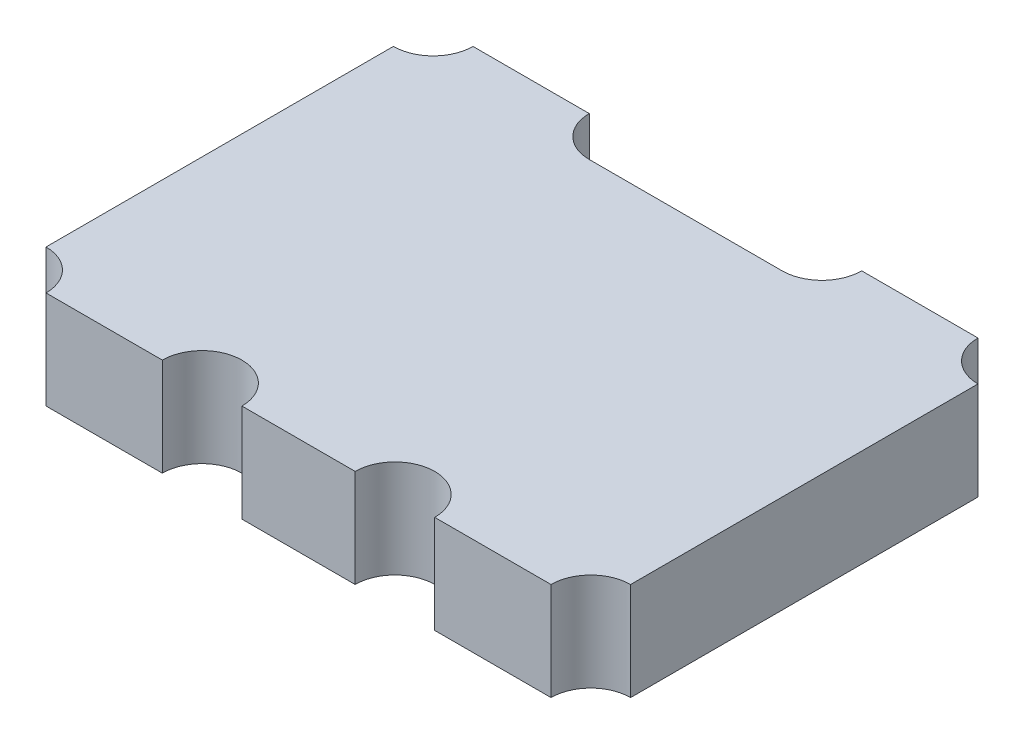
ISO-10303-21;
HEADER;
FILE_DESCRIPTION(('STEP AP214'),'2;1');
FILE_NAME('part.step','',(''),(''),'','','');
FILE_SCHEMA(('AUTOMOTIVE_DESIGN { 1 0 10303 214 1 1 1 1 }'));
ENDSEC;
DATA;
#1=APPLICATION_CONTEXT('core data for automotive mechanical design processes');
#2=APPLICATION_PROTOCOL_DEFINITION('international standard','automotive_design',2000,#1);
#3=PRODUCT_CONTEXT('',#1,'mechanical');
#4=PRODUCT('Part','Part','',(#3));
#5=PRODUCT_RELATED_PRODUCT_CATEGORY('part','',(#4));
#6=PRODUCT_DEFINITION_FORMATION('','',#4);
#7=PRODUCT_DEFINITION_CONTEXT('part definition',#1,'design');
#8=PRODUCT_DEFINITION('design','',#6,#7);
#9=PRODUCT_DEFINITION_SHAPE('','',#8);
#10=(LENGTH_UNIT() NAMED_UNIT(*) SI_UNIT(.MILLI.,.METRE.));
#11=(NAMED_UNIT(*) PLANE_ANGLE_UNIT() SI_UNIT($,.RADIAN.));
#12=(NAMED_UNIT(*) SI_UNIT($,.STERADIAN.) SOLID_ANGLE_UNIT());
#13=UNCERTAINTY_MEASURE_WITH_UNIT(LENGTH_MEASURE(1.E-05),#10,'distance_accuracy_value','');
#14=(GEOMETRIC_REPRESENTATION_CONTEXT(3) GLOBAL_UNCERTAINTY_ASSIGNED_CONTEXT((#13)) GLOBAL_UNIT_ASSIGNED_CONTEXT((#10,
#11,#12)) REPRESENTATION_CONTEXT('',''));
#15=CARTESIAN_POINT('',(0.,0.,0.));
#16=DIRECTION('',(0.,0.,1.));
#17=DIRECTION('',(1.,0.,0.));
#18=AXIS2_PLACEMENT_3D('',#15,#16,#17);
#19=CARTESIAN_POINT('',(-1.91,-0.64,-1.395));
#20=DIRECTION('',(0.,1.,0.));
#21=DIRECTION('',(0.,0.,1.));
#22=AXIS2_PLACEMENT_3D('',#19,#20,#21);
#23=CYLINDRICAL_SURFACE('',#22,0.26);
#24=CARTESIAN_POINT('',(-1.91,0.,-1.395));
#25=DIRECTION('',(0.,-1.,0.));
#26=DIRECTION('',(0.,0.,1.));
#27=AXIS2_PLACEMENT_3D('',#24,#25,#26);
#28=CIRCLE('',#27,0.26);
#29=CARTESIAN_POINT('',(-1.65,0.,-1.395));
#30=VERTEX_POINT('',#29);
#31=CARTESIAN_POINT('',(-1.91,0.,-1.135));
#32=VERTEX_POINT('',#31);
#33=EDGE_CURVE('E11',#30,#32,#28,.T.);
#34=ORIENTED_EDGE('',*,*,#33,.F.);
#35=DIRECTION('',(0.,1.,0.));
#36=VECTOR('',#35,1.);
#37=CARTESIAN_POINT('',(-1.65,-0.64,-1.395));
#38=LINE('',#37,#36);
#39=CARTESIAN_POINT('',(-1.65,-0.64,-1.395));
#40=VERTEX_POINT('',#39);
#41=EDGE_CURVE('E24',#40,#30,#38,.T.);
#42=ORIENTED_EDGE('',*,*,#41,.F.);
#43=CARTESIAN_POINT('',(-1.91,-0.64,-1.395));
#44=DIRECTION('',(0.,-1.,0.));
#45=DIRECTION('',(0.,0.,1.));
#46=AXIS2_PLACEMENT_3D('',#43,#44,#45);
#47=CIRCLE('',#46,0.26);
#48=CARTESIAN_POINT('',(-1.91,-0.64,-1.135));
#49=VERTEX_POINT('',#48);
#50=EDGE_CURVE('E262',#40,#49,#47,.T.);
#51=ORIENTED_EDGE('',*,*,#50,.T.);
#52=DIRECTION('',(0.,1.,0.));
#53=VECTOR('',#52,1.);
#54=CARTESIAN_POINT('',(-1.91,-0.64,-1.135));
#55=LINE('',#54,#53);
#56=EDGE_CURVE('E37',#49,#32,#55,.T.);
#57=ORIENTED_EDGE('',*,*,#56,.T.);
#58=EDGE_LOOP('',(#34,#42,#51,#57));
#59=FACE_BOUND('',#58,.T.);
#60=ADVANCED_FACE('F17',(#59),#23,.F.);
#61=CARTESIAN_POINT('',(-1.65,-0.64,-1.395));
#62=DIRECTION('',(0.,0.,-1.));
#63=DIRECTION('',(-1.,0.,0.));
#64=AXIS2_PLACEMENT_3D('',#61,#62,#63);
#65=PLANE('',#64);
#66=DIRECTION('',(-1.,0.,0.));
#67=VECTOR('',#66,1.);
#68=CARTESIAN_POINT('',(-1.65,0.,-1.395));
#69=LINE('',#68,#67);
#70=CARTESIAN_POINT('',(-0.89,0.,-1.395));
#71=VERTEX_POINT('',#70);
#72=EDGE_CURVE('E258',#71,#30,#69,.T.);
#73=ORIENTED_EDGE('',*,*,#72,.F.);
#74=DIRECTION('',(0.,1.,0.));
#75=VECTOR('',#74,1.);
#76=CARTESIAN_POINT('',(-0.89,-0.64,-1.395));
#77=LINE('',#76,#75);
#78=CARTESIAN_POINT('',(-0.89,-0.64,-1.395));
#79=VERTEX_POINT('',#78);
#80=EDGE_CURVE('E255',#79,#71,#77,.T.);
#81=ORIENTED_EDGE('',*,*,#80,.F.);
#82=DIRECTION('',(-1.,0.,0.));
#83=VECTOR('',#82,1.);
#84=CARTESIAN_POINT('',(-1.65,-0.64,-1.395));
#85=LINE('',#84,#83);
#86=EDGE_CURVE('E253',#79,#40,#85,.T.);
#87=ORIENTED_EDGE('',*,*,#86,.T.);
#88=ORIENTED_EDGE('',*,*,#41,.T.);
#89=EDGE_LOOP('',(#73,#81,#87,#88));
#90=FACE_BOUND('',#89,.T.);
#91=ADVANCED_FACE('F307',(#90),#65,.T.);
#92=CARTESIAN_POINT('',(-0.63,-0.64,-1.395));
#93=DIRECTION('',(0.,1.,0.));
#94=DIRECTION('',(0.,0.,1.));
#95=AXIS2_PLACEMENT_3D('',#92,#93,#94);
#96=CYLINDRICAL_SURFACE('',#95,0.26);
#97=CARTESIAN_POINT('',(-0.63,0.,-1.395));
#98=DIRECTION('',(0.,-1.,0.));
#99=DIRECTION('',(0.,0.,-1.));
#100=AXIS2_PLACEMENT_3D('',#97,#98,#99);
#101=CIRCLE('',#100,0.26);
#102=CARTESIAN_POINT('',(-0.629999999999999,0.,-1.135));
#103=VERTEX_POINT('',#102);
#104=EDGE_CURVE('E250',#103,#71,#101,.T.);
#105=ORIENTED_EDGE('',*,*,#104,.F.);
#106=DIRECTION('',(0.,1.,0.));
#107=VECTOR('',#106,1.);
#108=CARTESIAN_POINT('',(-0.629999999999999,-0.64,-1.135));
#109=LINE('',#108,#107);
#110=CARTESIAN_POINT('',(-0.629999999999999,-0.64,-1.135));
#111=VERTEX_POINT('',#110);
#112=EDGE_CURVE('E248',#111,#103,#109,.T.);
#113=ORIENTED_EDGE('',*,*,#112,.F.);
#114=CARTESIAN_POINT('',(-0.63,-0.64,-1.395));
#115=DIRECTION('',(0.,-1.,0.));
#116=DIRECTION('',(0.,0.,-1.));
#117=AXIS2_PLACEMENT_3D('',#114,#115,#116);
#118=CIRCLE('',#117,0.26);
#119=EDGE_CURVE('E245',#111,#79,#118,.T.);
#120=ORIENTED_EDGE('',*,*,#119,.T.);
#121=ORIENTED_EDGE('',*,*,#80,.T.);
#122=EDGE_LOOP('',(#105,#113,#120,#121));
#123=FACE_BOUND('',#122,.T.);
#124=ADVANCED_FACE('F268',(#123),#96,.F.);
#125=CARTESIAN_POINT('',(-0.629999999999999,-0.64,-1.135));
#126=DIRECTION('',(0.,0.,-1.));
#127=DIRECTION('',(-1.,0.,0.));
#128=AXIS2_PLACEMENT_3D('',#125,#126,#127);
#129=PLANE('',#128);
#130=DIRECTION('',(-1.,0.,0.));
#131=VECTOR('',#130,1.);
#132=CARTESIAN_POINT('',(-0.629999999999999,0.,-1.135));
#133=LINE('',#132,#131);
#134=CARTESIAN_POINT('',(0.629999999999999,0.,-1.135));
#135=VERTEX_POINT('',#134);
#136=EDGE_CURVE('E242',#135,#103,#133,.T.);
#137=ORIENTED_EDGE('',*,*,#136,.F.);
#138=DIRECTION('',(0.,1.,0.));
#139=VECTOR('',#138,1.);
#140=CARTESIAN_POINT('',(0.629999999999999,-0.64,-1.135));
#141=LINE('',#140,#139);
#142=CARTESIAN_POINT('',(0.629999999999999,-0.64,-1.135));
#143=VERTEX_POINT('',#142);
#144=EDGE_CURVE('E239',#143,#135,#141,.T.);
#145=ORIENTED_EDGE('',*,*,#144,.F.);
#146=DIRECTION('',(-1.,0.,0.));
#147=VECTOR('',#146,1.);
#148=CARTESIAN_POINT('',(-0.629999999999999,-0.64,-1.135));
#149=LINE('',#148,#147);
#150=EDGE_CURVE('E236',#143,#111,#149,.T.);
#151=ORIENTED_EDGE('',*,*,#150,.T.);
#152=ORIENTED_EDGE('',*,*,#112,.T.);
#153=EDGE_LOOP('',(#137,#145,#151,#152));
#154=FACE_BOUND('',#153,.T.);
#155=ADVANCED_FACE('F270',(#154),#129,.T.);
#156=CARTESIAN_POINT('',(0.63,-0.64,-1.395));
#157=DIRECTION('',(0.,1.,0.));
#158=DIRECTION('',(0.,0.,1.));
#159=AXIS2_PLACEMENT_3D('',#156,#157,#158);
#160=CYLINDRICAL_SURFACE('',#159,0.26);
#161=CARTESIAN_POINT('',(0.63,0.,-1.395));
#162=DIRECTION('',(0.,-1.,0.));
#163=DIRECTION('',(0.,0.,1.));
#164=AXIS2_PLACEMENT_3D('',#161,#162,#163);
#165=CIRCLE('',#164,0.26);
#166=CARTESIAN_POINT('',(0.89,0.,-1.395));
#167=VERTEX_POINT('',#166);
#168=EDGE_CURVE('E233',#167,#135,#165,.T.);
#169=ORIENTED_EDGE('',*,*,#168,.F.);
#170=DIRECTION('',(0.,1.,0.));
#171=VECTOR('',#170,1.);
#172=CARTESIAN_POINT('',(0.89,-0.64,-1.395));
#173=LINE('',#172,#171);
#174=CARTESIAN_POINT('',(0.89,-0.64,-1.395));
#175=VERTEX_POINT('',#174);
#176=EDGE_CURVE('E231',#175,#167,#173,.T.);
#177=ORIENTED_EDGE('',*,*,#176,.F.);
#178=CARTESIAN_POINT('',(0.63,-0.64,-1.395));
#179=DIRECTION('',(0.,-1.,0.));
#180=DIRECTION('',(0.,0.,1.));
#181=AXIS2_PLACEMENT_3D('',#178,#179,#180);
#182=CIRCLE('',#181,0.26);
#183=EDGE_CURVE('E228',#175,#143,#182,.T.);
#184=ORIENTED_EDGE('',*,*,#183,.T.);
#185=ORIENTED_EDGE('',*,*,#144,.T.);
#186=EDGE_LOOP('',(#169,#177,#184,#185));
#187=FACE_BOUND('',#186,.T.);
#188=ADVANCED_FACE('F275',(#187),#160,.F.);
#189=CARTESIAN_POINT('',(0.89,-0.64,-1.395));
#190=DIRECTION('',(0.,0.,-1.));
#191=DIRECTION('',(-1.,0.,0.));
#192=AXIS2_PLACEMENT_3D('',#189,#190,#191);
#193=PLANE('',#192);
#194=DIRECTION('',(-1.,0.,0.));
#195=VECTOR('',#194,1.);
#196=CARTESIAN_POINT('',(0.89,0.,-1.395));
#197=LINE('',#196,#195);
#198=CARTESIAN_POINT('',(1.65,0.,-1.395));
#199=VERTEX_POINT('',#198);
#200=EDGE_CURVE('E225',#199,#167,#197,.T.);
#201=ORIENTED_EDGE('',*,*,#200,.F.);
#202=DIRECTION('',(0.,1.,0.));
#203=VECTOR('',#202,1.);
#204=CARTESIAN_POINT('',(1.65,-0.64,-1.395));
#205=LINE('',#204,#203);
#206=CARTESIAN_POINT('',(1.65,-0.64,-1.395));
#207=VERTEX_POINT('',#206);
#208=EDGE_CURVE('E222',#207,#199,#205,.T.);
#209=ORIENTED_EDGE('',*,*,#208,.F.);
#210=DIRECTION('',(-1.,0.,0.));
#211=VECTOR('',#210,1.);
#212=CARTESIAN_POINT('',(0.89,-0.64,-1.395));
#213=LINE('',#212,#211);
#214=EDGE_CURVE('E219',#207,#175,#213,.T.);
#215=ORIENTED_EDGE('',*,*,#214,.T.);
#216=ORIENTED_EDGE('',*,*,#176,.T.);
#217=EDGE_LOOP('',(#201,#209,#215,#216));
#218=FACE_BOUND('',#217,.T.);
#219=ADVANCED_FACE('F277',(#218),#193,.T.);
#220=CARTESIAN_POINT('',(1.91,-0.64,-1.395));
#221=DIRECTION('',(0.,1.,0.));
#222=DIRECTION('',(0.,0.,1.));
#223=AXIS2_PLACEMENT_3D('',#220,#221,#222);
#224=CYLINDRICAL_SURFACE('',#223,0.26);
#225=CARTESIAN_POINT('',(1.91,0.,-1.395));
#226=DIRECTION('',(0.,-1.,0.));
#227=DIRECTION('',(0.,0.,-1.));
#228=AXIS2_PLACEMENT_3D('',#225,#226,#227);
#229=CIRCLE('',#228,0.26);
#230=CARTESIAN_POINT('',(1.91,0.,-1.135));
#231=VERTEX_POINT('',#230);
#232=EDGE_CURVE('E216',#231,#199,#229,.T.);
#233=ORIENTED_EDGE('',*,*,#232,.F.);
#234=DIRECTION('',(0.,1.,0.));
#235=VECTOR('',#234,1.);
#236=CARTESIAN_POINT('',(1.91,-0.64,-1.135));
#237=LINE('',#236,#235);
#238=CARTESIAN_POINT('',(1.91,-0.64,-1.135));
#239=VERTEX_POINT('',#238);
#240=EDGE_CURVE('E214',#239,#231,#237,.T.);
#241=ORIENTED_EDGE('',*,*,#240,.F.);
#242=CARTESIAN_POINT('',(1.91,-0.64,-1.395));
#243=DIRECTION('',(0.,-1.,0.));
#244=DIRECTION('',(0.,0.,-1.));
#245=AXIS2_PLACEMENT_3D('',#242,#243,#244);
#246=CIRCLE('',#245,0.26);
#247=EDGE_CURVE('E211',#239,#207,#246,.T.);
#248=ORIENTED_EDGE('',*,*,#247,.T.);
#249=ORIENTED_EDGE('',*,*,#208,.T.);
#250=EDGE_LOOP('',(#233,#241,#248,#249));
#251=FACE_BOUND('',#250,.T.);
#252=ADVANCED_FACE('F282',(#251),#224,.F.);
#253=CARTESIAN_POINT('',(1.91,-0.64,-1.135));
#254=DIRECTION('',(1.,0.,0.));
#255=DIRECTION('',(0.,0.,-1.));
#256=AXIS2_PLACEMENT_3D('',#253,#254,#255);
#257=PLANE('',#256);
#258=DIRECTION('',(0.,0.,-1.));
#259=VECTOR('',#258,1.);
#260=CARTESIAN_POINT('',(1.91,0.,-1.135));
#261=LINE('',#260,#259);
#262=CARTESIAN_POINT('',(1.91,0.,1.135));
#263=VERTEX_POINT('',#262);
#264=EDGE_CURVE('E208',#263,#231,#261,.T.);
#265=ORIENTED_EDGE('',*,*,#264,.F.);
#266=DIRECTION('',(0.,1.,0.));
#267=VECTOR('',#266,1.);
#268=CARTESIAN_POINT('',(1.91,-0.64,1.135));
#269=LINE('',#268,#267);
#270=CARTESIAN_POINT('',(1.91,-0.64,1.135));
#271=VERTEX_POINT('',#270);
#272=EDGE_CURVE('E205',#271,#263,#269,.T.);
#273=ORIENTED_EDGE('',*,*,#272,.F.);
#274=DIRECTION('',(0.,0.,-1.));
#275=VECTOR('',#274,1.);
#276=CARTESIAN_POINT('',(1.91,-0.64,-1.135));
#277=LINE('',#276,#275);
#278=EDGE_CURVE('E202',#271,#239,#277,.T.);
#279=ORIENTED_EDGE('',*,*,#278,.T.);
#280=ORIENTED_EDGE('',*,*,#240,.T.);
#281=EDGE_LOOP('',(#265,#273,#279,#280));
#282=FACE_BOUND('',#281,.T.);
#283=ADVANCED_FACE('F284',(#282),#257,.T.);
#284=CARTESIAN_POINT('',(1.91,-0.64,1.395));
#285=DIRECTION('',(0.,1.,0.));
#286=DIRECTION('',(0.,0.,1.));
#287=AXIS2_PLACEMENT_3D('',#284,#285,#286);
#288=CYLINDRICAL_SURFACE('',#287,0.26);
#289=CARTESIAN_POINT('',(1.91,0.,1.395));
#290=DIRECTION('',(0.,-1.,0.));
#291=DIRECTION('',(0.,0.,1.));
#292=AXIS2_PLACEMENT_3D('',#289,#290,#291);
#293=CIRCLE('',#292,0.26);
#294=CARTESIAN_POINT('',(1.65,0.,1.395));
#295=VERTEX_POINT('',#294);
#296=EDGE_CURVE('E199',#295,#263,#293,.T.);
#297=ORIENTED_EDGE('',*,*,#296,.F.);
#298=DIRECTION('',(0.,1.,0.));
#299=VECTOR('',#298,1.);
#300=CARTESIAN_POINT('',(1.65,-0.64,1.395));
#301=LINE('',#300,#299);
#302=CARTESIAN_POINT('',(1.65,-0.64,1.395));
#303=VERTEX_POINT('',#302);
#304=EDGE_CURVE('E197',#303,#295,#301,.T.);
#305=ORIENTED_EDGE('',*,*,#304,.F.);
#306=CARTESIAN_POINT('',(1.91,-0.64,1.395));
#307=DIRECTION('',(0.,-1.,0.));
#308=DIRECTION('',(0.,0.,1.));
#309=AXIS2_PLACEMENT_3D('',#306,#307,#308);
#310=CIRCLE('',#309,0.26);
#311=EDGE_CURVE('E194',#303,#271,#310,.T.);
#312=ORIENTED_EDGE('',*,*,#311,.T.);
#313=ORIENTED_EDGE('',*,*,#272,.T.);
#314=EDGE_LOOP('',(#297,#305,#312,#313));
#315=FACE_BOUND('',#314,.T.);
#316=ADVANCED_FACE('F289',(#315),#288,.F.);
#317=CARTESIAN_POINT('',(1.65,-0.64,1.395));
#318=DIRECTION('',(0.,0.,1.));
#319=DIRECTION('',(1.,0.,0.));
#320=AXIS2_PLACEMENT_3D('',#317,#318,#319);
#321=PLANE('',#320);
#322=DIRECTION('',(1.,0.,0.));
#323=VECTOR('',#322,1.);
#324=CARTESIAN_POINT('',(1.65,0.,1.395));
#325=LINE('',#324,#323);
#326=CARTESIAN_POINT('',(0.89,0.,1.395));
#327=VERTEX_POINT('',#326);
#328=EDGE_CURVE('E191',#327,#295,#325,.T.);
#329=ORIENTED_EDGE('',*,*,#328,.F.);
#330=DIRECTION('',(0.,1.,0.));
#331=VECTOR('',#330,1.);
#332=CARTESIAN_POINT('',(0.89,-0.64,1.395));
#333=LINE('',#332,#331);
#334=CARTESIAN_POINT('',(0.89,-0.64,1.395));
#335=VERTEX_POINT('',#334);
#336=EDGE_CURVE('E188',#335,#327,#333,.T.);
#337=ORIENTED_EDGE('',*,*,#336,.F.);
#338=DIRECTION('',(1.,0.,0.));
#339=VECTOR('',#338,1.);
#340=CARTESIAN_POINT('',(1.65,-0.64,1.395));
#341=LINE('',#340,#339);
#342=EDGE_CURVE('E185',#335,#303,#341,.T.);
#343=ORIENTED_EDGE('',*,*,#342,.T.);
#344=ORIENTED_EDGE('',*,*,#304,.T.);
#345=EDGE_LOOP('',(#329,#337,#343,#344));
#346=FACE_BOUND('',#345,.T.);
#347=ADVANCED_FACE('F291',(#346),#321,.T.);
#348=CARTESIAN_POINT('',(0.63,-0.64,1.395));
#349=DIRECTION('',(0.,1.,0.));
#350=DIRECTION('',(0.,0.,1.));
#351=AXIS2_PLACEMENT_3D('',#348,#349,#350);
#352=CYLINDRICAL_SURFACE('',#351,0.26);
#353=CARTESIAN_POINT('',(0.63,0.,1.395));
#354=DIRECTION('',(0.,-1.,0.));
#355=DIRECTION('',(0.,0.,-1.));
#356=AXIS2_PLACEMENT_3D('',#353,#354,#355);
#357=CIRCLE('',#356,0.26);
#358=CARTESIAN_POINT('',(0.370000000000009,0.,1.395));
#359=VERTEX_POINT('',#358);
#360=EDGE_CURVE('E182',#359,#327,#357,.T.);
#361=ORIENTED_EDGE('',*,*,#360,.F.);
#362=DIRECTION('',(0.,1.,0.));
#363=VECTOR('',#362,1.);
#364=CARTESIAN_POINT('',(0.370000000000009,-0.64,1.395));
#365=LINE('',#364,#363);
#366=CARTESIAN_POINT('',(0.370000000000009,-0.64,1.395));
#367=VERTEX_POINT('',#366);
#368=EDGE_CURVE('E180',#367,#359,#365,.T.);
#369=ORIENTED_EDGE('',*,*,#368,.F.);
#370=CARTESIAN_POINT('',(0.63,-0.64,1.395));
#371=DIRECTION('',(0.,-1.,0.));
#372=DIRECTION('',(0.,0.,1.));
#373=AXIS2_PLACEMENT_3D('',#370,#371,#372);
#374=CIRCLE('',#373,0.259999999999995);
#375=EDGE_CURVE('E177',#367,#335,#374,.T.);
#376=ORIENTED_EDGE('',*,*,#375,.T.);
#377=ORIENTED_EDGE('',*,*,#336,.T.);
#378=EDGE_LOOP('',(#361,#369,#376,#377));
#379=FACE_BOUND('',#378,.T.);
#380=ADVANCED_FACE('F296',(#379),#352,.F.);
#381=CARTESIAN_POINT('',(-0.369999999999999,-0.64,1.395));
#382=DIRECTION('',(0.,0.,1.));
#383=DIRECTION('',(1.,0.,0.));
#384=AXIS2_PLACEMENT_3D('',#381,#382,#383);
#385=PLANE('',#384);
#386=DIRECTION('',(1.,0.,0.));
#387=VECTOR('',#386,1.);
#388=CARTESIAN_POINT('',(-0.369999999999999,0.,1.395));
#389=LINE('',#388,#387);
#390=CARTESIAN_POINT('',(-0.37,0.,1.395));
#391=VERTEX_POINT('',#390);
#392=EDGE_CURVE('E174',#391,#359,#389,.T.);
#393=ORIENTED_EDGE('',*,*,#392,.F.);
#394=DIRECTION('',(0.,1.,0.));
#395=VECTOR('',#394,1.);
#396=CARTESIAN_POINT('',(-0.37,-0.64,1.395));
#397=LINE('',#396,#395);
#398=CARTESIAN_POINT('',(-0.37,-0.64,1.395));
#399=VERTEX_POINT('',#398);
#400=EDGE_CURVE('E171',#399,#391,#397,.T.);
#401=ORIENTED_EDGE('',*,*,#400,.F.);
#402=DIRECTION('',(1.,0.,0.));
#403=VECTOR('',#402,1.);
#404=CARTESIAN_POINT('',(-0.369999999999999,-0.64,1.395));
#405=LINE('',#404,#403);
#406=EDGE_CURVE('E168',#399,#367,#405,.T.);
#407=ORIENTED_EDGE('',*,*,#406,.T.);
#408=ORIENTED_EDGE('',*,*,#368,.T.);
#409=EDGE_LOOP('',(#393,#401,#407,#408));
#410=FACE_BOUND('',#409,.T.);
#411=ADVANCED_FACE('F298',(#410),#385,.T.);
#412=CARTESIAN_POINT('',(-0.63,-0.64,1.395));
#413=DIRECTION('',(0.,1.,0.));
#414=DIRECTION('',(0.,0.,1.));
#415=AXIS2_PLACEMENT_3D('',#412,#413,#414);
#416=CYLINDRICAL_SURFACE('',#415,0.26);
#417=CARTESIAN_POINT('',(-0.63,0.,1.395));
#418=DIRECTION('',(0.,-1.,0.));
#419=DIRECTION('',(0.,0.,-1.));
#420=AXIS2_PLACEMENT_3D('',#417,#418,#419);
#421=CIRCLE('',#420,0.26);
#422=CARTESIAN_POINT('',(-0.89,0.,1.395));
#423=VERTEX_POINT('',#422);
#424=EDGE_CURVE('E165',#423,#391,#421,.T.);
#425=ORIENTED_EDGE('',*,*,#424,.F.);
#426=DIRECTION('',(0.,1.,0.));
#427=VECTOR('',#426,1.);
#428=CARTESIAN_POINT('',(-0.89,-0.64,1.395));
#429=LINE('',#428,#427);
#430=CARTESIAN_POINT('',(-0.89,-0.64,1.395));
#431=VERTEX_POINT('',#430);
#432=EDGE_CURVE('E163',#431,#423,#429,.T.);
#433=ORIENTED_EDGE('',*,*,#432,.F.);
#434=CARTESIAN_POINT('',(-0.63,-0.64,1.395));
#435=DIRECTION('',(0.,-1.,0.));
#436=DIRECTION('',(0.,0.,1.));
#437=AXIS2_PLACEMENT_3D('',#434,#435,#436);
#438=CIRCLE('',#437,0.26);
#439=EDGE_CURVE('E160',#431,#399,#438,.T.);
#440=ORIENTED_EDGE('',*,*,#439,.T.);
#441=ORIENTED_EDGE('',*,*,#400,.T.);
#442=EDGE_LOOP('',(#425,#433,#440,#441));
#443=FACE_BOUND('',#442,.T.);
#444=ADVANCED_FACE('F302',(#443),#416,.F.);
#445=CARTESIAN_POINT('',(-1.65,-0.64,1.395));
#446=DIRECTION('',(0.,0.,1.));
#447=DIRECTION('',(1.,0.,0.));
#448=AXIS2_PLACEMENT_3D('',#445,#446,#447);
#449=PLANE('',#448);
#450=DIRECTION('',(1.,0.,0.));
#451=VECTOR('',#450,1.);
#452=CARTESIAN_POINT('',(-1.65,0.,1.395));
#453=LINE('',#452,#451);
#454=CARTESIAN_POINT('',(-1.65,0.,1.395));
#455=VERTEX_POINT('',#454);
#456=EDGE_CURVE('E157',#455,#423,#453,.T.);
#457=ORIENTED_EDGE('',*,*,#456,.F.);
#458=DIRECTION('',(0.,1.,0.));
#459=VECTOR('',#458,1.);
#460=CARTESIAN_POINT('',(-1.65,-0.64,1.395));
#461=LINE('',#460,#459);
#462=CARTESIAN_POINT('',(-1.65,-0.64,1.395));
#463=VERTEX_POINT('',#462);
#464=EDGE_CURVE('E155',#463,#455,#461,.T.);
#465=ORIENTED_EDGE('',*,*,#464,.F.);
#466=DIRECTION('',(1.,0.,0.));
#467=VECTOR('',#466,1.);
#468=CARTESIAN_POINT('',(-1.65,-0.64,1.395));
#469=LINE('',#468,#467);
#470=EDGE_CURVE('E135',#463,#431,#469,.T.);
#471=ORIENTED_EDGE('',*,*,#470,.T.);
#472=ORIENTED_EDGE('',*,*,#432,.T.);
#473=EDGE_LOOP('',(#457,#465,#471,#472));
#474=FACE_BOUND('',#473,.T.);
#475=ADVANCED_FACE('F304',(#474),#449,.T.);
#476=CARTESIAN_POINT('',(-1.91,-0.64,1.395));
#477=DIRECTION('',(0.,1.,0.));
#478=DIRECTION('',(0.,0.,1.));
#479=AXIS2_PLACEMENT_3D('',#476,#477,#478);
#480=CYLINDRICAL_SURFACE('',#479,0.26);
#481=CARTESIAN_POINT('',(-1.91,0.,1.395));
#482=DIRECTION('',(0.,-1.,0.));
#483=DIRECTION('',(0.,0.,-1.));
#484=AXIS2_PLACEMENT_3D('',#481,#482,#483);
#485=CIRCLE('',#484,0.26);
#486=CARTESIAN_POINT('',(-1.91,0.,1.135));
#487=VERTEX_POINT('',#486);
#488=EDGE_CURVE('E144',#487,#455,#485,.T.);
#489=ORIENTED_EDGE('',*,*,#488,.F.);
#490=DIRECTION('',(0.,1.,0.));
#491=VECTOR('',#490,1.);
#492=CARTESIAN_POINT('',(-1.91,-0.64,1.135));
#493=LINE('',#492,#491);
#494=CARTESIAN_POINT('',(-1.91,-0.64,1.135));
#495=VERTEX_POINT('',#494);
#496=EDGE_CURVE('E138',#495,#487,#493,.T.);
#497=ORIENTED_EDGE('',*,*,#496,.F.);
#498=CARTESIAN_POINT('',(-1.91,-0.64,1.395));
#499=DIRECTION('',(0.,-1.,0.));
#500=DIRECTION('',(0.,0.,-1.));
#501=AXIS2_PLACEMENT_3D('',#498,#499,#500);
#502=CIRCLE('',#501,0.26);
#503=EDGE_CURVE('E129',#495,#463,#502,.T.);
#504=ORIENTED_EDGE('',*,*,#503,.T.);
#505=ORIENTED_EDGE('',*,*,#464,.T.);
#506=EDGE_LOOP('',(#489,#497,#504,#505));
#507=FACE_BOUND('',#506,.T.);
#508=ADVANCED_FACE('F142',(#507),#480,.F.);
#509=CARTESIAN_POINT('',(-1.91,-0.64,-1.135));
#510=DIRECTION('',(-1.,0.,0.));
#511=DIRECTION('',(0.,0.,1.));
#512=AXIS2_PLACEMENT_3D('',#509,#510,#511);
#513=PLANE('',#512);
#514=DIRECTION('',(0.,0.,1.));
#515=VECTOR('',#514,1.);
#516=CARTESIAN_POINT('',(-1.91,0.,-1.135));
#517=LINE('',#516,#515);
#518=EDGE_CURVE('E139',#32,#487,#517,.T.);
#519=ORIENTED_EDGE('',*,*,#518,.F.);
#520=ORIENTED_EDGE('',*,*,#56,.F.);
#521=DIRECTION('',(0.,0.,1.));
#522=VECTOR('',#521,1.);
#523=CARTESIAN_POINT('',(-1.91,-0.64,-1.135));
#524=LINE('',#523,#522);
#525=EDGE_CURVE('E133',#49,#495,#524,.T.);
#526=ORIENTED_EDGE('',*,*,#525,.T.);
#527=ORIENTED_EDGE('',*,*,#496,.T.);
#528=EDGE_LOOP('',(#519,#520,#526,#527));
#529=FACE_BOUND('',#528,.T.);
#530=ADVANCED_FACE('F149',(#529),#513,.T.);
#531=CARTESIAN_POINT('',(-1.91,-0.64,-1.395));
#532=DIRECTION('',(0.,1.,0.));
#533=DIRECTION('',(0.,0.,1.));
#534=AXIS2_PLACEMENT_3D('',#531,#532,#533);
#535=PLANE('',#534);
#536=ORIENTED_EDGE('',*,*,#50,.F.);
#537=ORIENTED_EDGE('',*,*,#86,.F.);
#538=ORIENTED_EDGE('',*,*,#119,.F.);
#539=ORIENTED_EDGE('',*,*,#150,.F.);
#540=ORIENTED_EDGE('',*,*,#183,.F.);
#541=ORIENTED_EDGE('',*,*,#214,.F.);
#542=ORIENTED_EDGE('',*,*,#247,.F.);
#543=ORIENTED_EDGE('',*,*,#278,.F.);
#544=ORIENTED_EDGE('',*,*,#311,.F.);
#545=ORIENTED_EDGE('',*,*,#342,.F.);
#546=ORIENTED_EDGE('',*,*,#375,.F.);
#547=ORIENTED_EDGE('',*,*,#406,.F.);
#548=ORIENTED_EDGE('',*,*,#439,.F.);
#549=ORIENTED_EDGE('',*,*,#470,.F.);
#550=ORIENTED_EDGE('',*,*,#503,.F.);
#551=ORIENTED_EDGE('',*,*,#525,.F.);
#552=EDGE_LOOP('',(#536,#537,#538,#539,#540,#541,#542,#543,#544,#545,#546,#547,#548,#549,#550,#551));
#553=FACE_BOUND('',#552,.T.);
#554=ADVANCED_FACE('F131',(#553),#535,.F.);
#555=CARTESIAN_POINT('',(-1.91,0.,-1.395));
#556=DIRECTION('',(0.,1.,0.));
#557=DIRECTION('',(0.,0.,1.));
#558=AXIS2_PLACEMENT_3D('',#555,#556,#557);
#559=PLANE('',#558);
#560=ORIENTED_EDGE('',*,*,#33,.T.);
#561=ORIENTED_EDGE('',*,*,#518,.T.);
#562=ORIENTED_EDGE('',*,*,#488,.T.);
#563=ORIENTED_EDGE('',*,*,#456,.T.);
#564=ORIENTED_EDGE('',*,*,#424,.T.);
#565=ORIENTED_EDGE('',*,*,#392,.T.);
#566=ORIENTED_EDGE('',*,*,#360,.T.);
#567=ORIENTED_EDGE('',*,*,#328,.T.);
#568=ORIENTED_EDGE('',*,*,#296,.T.);
#569=ORIENTED_EDGE('',*,*,#264,.T.);
#570=ORIENTED_EDGE('',*,*,#232,.T.);
#571=ORIENTED_EDGE('',*,*,#200,.T.);
#572=ORIENTED_EDGE('',*,*,#168,.T.);
#573=ORIENTED_EDGE('',*,*,#136,.T.);
#574=ORIENTED_EDGE('',*,*,#104,.T.);
#575=ORIENTED_EDGE('',*,*,#72,.T.);
#576=EDGE_LOOP('',(#560,#561,#562,#563,#564,#565,#566,#567,#568,#569,#570,#571,#572,#573,#574,#575));
#577=FACE_BOUND('',#576,.T.);
#578=ADVANCED_FACE('F306',(#577),#559,.T.);
#579=CLOSED_SHELL('',(#60,#91,#124,#155,#188,#219,#252,#283,#316,#347,#380,#411,#444,#475,#508,
#530,#554,#578));
#580=MANIFOLD_SOLID_BREP('B1',#579);
#581=ADVANCED_BREP_SHAPE_REPRESENTATION('',(#18,#580),#14);
#582=SHAPE_DEFINITION_REPRESENTATION(#9,#581);
ENDSEC;
END-ISO-10303-21;
